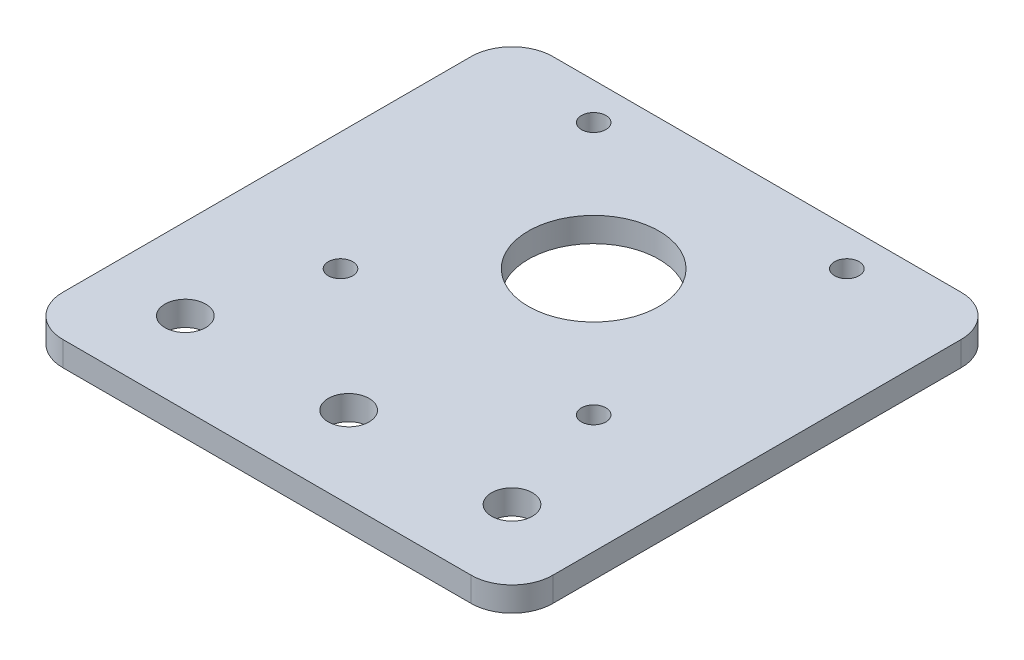
ISO-10303-21;
HEADER;
FILE_DESCRIPTION(('STEP AP214'),'2;1');
FILE_NAME('part.step','',(''),(''),'','','');
FILE_SCHEMA(('AUTOMOTIVE_DESIGN { 1 0 10303 214 1 1 1 1 }'));
ENDSEC;
DATA;
#1=APPLICATION_CONTEXT('core data for automotive mechanical design processes');
#2=APPLICATION_PROTOCOL_DEFINITION('international standard','automotive_design',2000,#1);
#3=PRODUCT_CONTEXT('',#1,'mechanical');
#4=PRODUCT('Part','Part','',(#3));
#5=PRODUCT_RELATED_PRODUCT_CATEGORY('part','',(#4));
#6=PRODUCT_DEFINITION_FORMATION('','',#4);
#7=PRODUCT_DEFINITION_CONTEXT('part definition',#1,'design');
#8=PRODUCT_DEFINITION('design','',#6,#7);
#9=PRODUCT_DEFINITION_SHAPE('','',#8);
#10=(LENGTH_UNIT() NAMED_UNIT(*) SI_UNIT(.MILLI.,.METRE.));
#11=(NAMED_UNIT(*) PLANE_ANGLE_UNIT() SI_UNIT($,.RADIAN.));
#12=(NAMED_UNIT(*) SI_UNIT($,.STERADIAN.) SOLID_ANGLE_UNIT());
#13=UNCERTAINTY_MEASURE_WITH_UNIT(LENGTH_MEASURE(1.E-05),#10,'distance_accuracy_value','');
#14=(GEOMETRIC_REPRESENTATION_CONTEXT(3) GLOBAL_UNCERTAINTY_ASSIGNED_CONTEXT((#13)) GLOBAL_UNIT_ASSIGNED_CONTEXT((#10,
#11,#12)) REPRESENTATION_CONTEXT('',''));
#15=CARTESIAN_POINT('',(0.,0.,0.));
#16=DIRECTION('',(0.,0.,1.));
#17=DIRECTION('',(1.,0.,0.));
#18=AXIS2_PLACEMENT_3D('',#15,#16,#17);
#19=CARTESIAN_POINT('',(0.,3.,0.));
#20=DIRECTION('',(0.,-1.,0.));
#21=DIRECTION('',(0.,0.,-1.));
#22=AXIS2_PLACEMENT_3D('',#19,#20,#21);
#23=PLANE('',#22);
#24=CARTESIAN_POINT('',(0.,3.,30.));
#25=DIRECTION('',(0.,1.,0.));
#26=DIRECTION('',(0.,0.,1.));
#27=AXIS2_PLACEMENT_3D('',#24,#25,#26);
#28=CIRCLE('',#27,2.5);
#29=CARTESIAN_POINT('',(0.,3.,32.5));
#30=VERTEX_POINT('',#29);
#31=EDGE_CURVE('E216',#30,#30,#28,.T.);
#32=ORIENTED_EDGE('',*,*,#31,.F.);
#33=EDGE_LOOP('',(#32));
#34=FACE_BOUND('',#33,.T.);
#35=CARTESIAN_POINT('',(-20.,3.,30.));
#36=DIRECTION('',(0.,1.,0.));
#37=DIRECTION('',(0.,0.,1.));
#38=AXIS2_PLACEMENT_3D('',#35,#36,#37);
#39=CIRCLE('',#38,2.5);
#40=CARTESIAN_POINT('',(-20.,3.,32.5));
#41=VERTEX_POINT('',#40);
#42=EDGE_CURVE('E213',#41,#41,#39,.T.);
#43=ORIENTED_EDGE('',*,*,#42,.F.);
#44=EDGE_LOOP('',(#43));
#45=FACE_BOUND('',#44,.T.);
#46=CARTESIAN_POINT('',(15.5,3.,-15.5));
#47=DIRECTION('',(0.,1.,0.));
#48=DIRECTION('',(0.,0.,1.));
#49=AXIS2_PLACEMENT_3D('',#46,#47,#48);
#50=CIRCLE('',#49,1.5);
#51=CARTESIAN_POINT('',(15.5,3.,-14.));
#52=VERTEX_POINT('',#51);
#53=EDGE_CURVE('E204',#52,#52,#50,.T.);
#54=ORIENTED_EDGE('',*,*,#53,.F.);
#55=EDGE_LOOP('',(#54));
#56=FACE_BOUND('',#55,.T.);
#57=CARTESIAN_POINT('',(-15.5,3.,-15.5));
#58=DIRECTION('',(0.,1.,0.));
#59=DIRECTION('',(0.,0.,1.));
#60=AXIS2_PLACEMENT_3D('',#57,#58,#59);
#61=CIRCLE('',#60,1.5);
#62=CARTESIAN_POINT('',(-15.5,3.,-14.));
#63=VERTEX_POINT('',#62);
#64=EDGE_CURVE('E201',#63,#63,#61,.T.);
#65=ORIENTED_EDGE('',*,*,#64,.F.);
#66=EDGE_LOOP('',(#65));
#67=FACE_BOUND('',#66,.T.);
#68=DIRECTION('',(1.,0.,0.));
#69=VECTOR('',#68,1.);
#70=CARTESIAN_POINT('',(-30.,3.,40.));
#71=LINE('',#70,#69);
#72=CARTESIAN_POINT('',(-25.,3.,40.));
#73=VERTEX_POINT('',#72);
#74=CARTESIAN_POINT('',(25.,3.,40.));
#75=VERTEX_POINT('',#74);
#76=EDGE_CURVE('E137',#73,#75,#71,.T.);
#77=ORIENTED_EDGE('',*,*,#76,.T.);
#78=CARTESIAN_POINT('',(25.,3.,35.));
#79=DIRECTION('',(0.,-1.,0.));
#80=DIRECTION('',(0.,0.,-1.));
#81=AXIS2_PLACEMENT_3D('',#78,#79,#80);
#82=CIRCLE('',#81,5.);
#83=CARTESIAN_POINT('',(30.,3.,35.));
#84=VERTEX_POINT('',#83);
#85=EDGE_CURVE('E170',#75,#84,#82,.F.);
#86=ORIENTED_EDGE('',*,*,#85,.T.);
#87=DIRECTION('',(0.,0.,-1.));
#88=VECTOR('',#87,1.);
#89=CARTESIAN_POINT('',(30.,3.,-20.));
#90=LINE('',#89,#88);
#91=CARTESIAN_POINT('',(30.,3.,-15.));
#92=VERTEX_POINT('',#91);
#93=EDGE_CURVE('E119',#84,#92,#90,.T.);
#94=ORIENTED_EDGE('',*,*,#93,.T.);
#95=CARTESIAN_POINT('',(25.,3.,-15.));
#96=DIRECTION('',(0.,-1.,0.));
#97=DIRECTION('',(0.,0.,-1.));
#98=AXIS2_PLACEMENT_3D('',#95,#96,#97);
#99=CIRCLE('',#98,5.);
#100=CARTESIAN_POINT('',(25.,3.,-20.));
#101=VERTEX_POINT('',#100);
#102=EDGE_CURVE('E168',#92,#101,#99,.F.);
#103=ORIENTED_EDGE('',*,*,#102,.T.);
#104=DIRECTION('',(-1.,0.,0.));
#105=VECTOR('',#104,1.);
#106=CARTESIAN_POINT('',(-30.,3.,-20.));
#107=LINE('',#106,#105);
#108=CARTESIAN_POINT('',(-25.,3.,-20.));
#109=VERTEX_POINT('',#108);
#110=EDGE_CURVE('E181',#101,#109,#107,.T.);
#111=ORIENTED_EDGE('',*,*,#110,.T.);
#112=CARTESIAN_POINT('',(-25.,3.,-15.));
#113=DIRECTION('',(0.,-1.,0.));
#114=DIRECTION('',(0.,0.,-1.));
#115=AXIS2_PLACEMENT_3D('',#112,#113,#114);
#116=CIRCLE('',#115,5.);
#117=CARTESIAN_POINT('',(-30.,3.,-15.));
#118=VERTEX_POINT('',#117);
#119=EDGE_CURVE('E54',#109,#118,#116,.F.);
#120=ORIENTED_EDGE('',*,*,#119,.T.);
#121=DIRECTION('',(0.,0.,1.));
#122=VECTOR('',#121,1.);
#123=CARTESIAN_POINT('',(-30.,3.,-20.));
#124=LINE('',#123,#122);
#125=CARTESIAN_POINT('',(-30.,3.,35.));
#126=VERTEX_POINT('',#125);
#127=EDGE_CURVE('E142',#118,#126,#124,.T.);
#128=ORIENTED_EDGE('',*,*,#127,.T.);
#129=CARTESIAN_POINT('',(-25.,3.,35.));
#130=DIRECTION('',(0.,-1.,0.));
#131=DIRECTION('',(0.,0.,-1.));
#132=AXIS2_PLACEMENT_3D('',#129,#130,#131);
#133=CIRCLE('',#132,5.);
#134=EDGE_CURVE('E165',#126,#73,#133,.F.);
#135=ORIENTED_EDGE('',*,*,#134,.T.);
#136=EDGE_LOOP('',(#77,#86,#94,#103,#111,#120,#128,#135));
#137=FACE_BOUND('',#136,.T.);
#138=CARTESIAN_POINT('',(0.,3.,0.));
#139=DIRECTION('',(0.,1.,0.));
#140=DIRECTION('',(0.,0.,1.));
#141=AXIS2_PLACEMENT_3D('',#138,#139,#140);
#142=CIRCLE('',#141,8.);
#143=CARTESIAN_POINT('',(0.,3.,8.));
#144=VERTEX_POINT('',#143);
#145=EDGE_CURVE('E132',#144,#144,#142,.T.);
#146=ORIENTED_EDGE('',*,*,#145,.F.);
#147=EDGE_LOOP('',(#146));
#148=FACE_BOUND('',#147,.T.);
#149=CARTESIAN_POINT('',(-15.5,3.,15.5));
#150=DIRECTION('',(0.,1.,0.));
#151=DIRECTION('',(0.,0.,1.));
#152=AXIS2_PLACEMENT_3D('',#149,#150,#151);
#153=CIRCLE('',#152,1.5);
#154=CARTESIAN_POINT('',(-15.5,3.,17.));
#155=VERTEX_POINT('',#154);
#156=EDGE_CURVE('E141',#155,#155,#153,.T.);
#157=ORIENTED_EDGE('',*,*,#156,.F.);
#158=EDGE_LOOP('',(#157));
#159=FACE_BOUND('',#158,.T.);
#160=CARTESIAN_POINT('',(15.5,3.,15.5));
#161=DIRECTION('',(0.,1.,0.));
#162=DIRECTION('',(0.,0.,1.));
#163=AXIS2_PLACEMENT_3D('',#160,#161,#162);
#164=CIRCLE('',#163,1.5);
#165=CARTESIAN_POINT('',(15.5,3.,17.));
#166=VERTEX_POINT('',#165);
#167=EDGE_CURVE('E148',#166,#166,#164,.T.);
#168=ORIENTED_EDGE('',*,*,#167,.F.);
#169=EDGE_LOOP('',(#168));
#170=FACE_BOUND('',#169,.T.);
#171=CARTESIAN_POINT('',(20.,3.,30.));
#172=DIRECTION('',(0.,1.,0.));
#173=DIRECTION('',(0.,0.,1.));
#174=AXIS2_PLACEMENT_3D('',#171,#172,#173);
#175=CIRCLE('',#174,2.5);
#176=CARTESIAN_POINT('',(20.,3.,32.5));
#177=VERTEX_POINT('',#176);
#178=EDGE_CURVE('E154',#177,#177,#175,.T.);
#179=ORIENTED_EDGE('',*,*,#178,.F.);
#180=EDGE_LOOP('',(#179));
#181=FACE_BOUND('',#180,.T.);
#182=ADVANCED_FACE('F33',(#34,#45,#56,#67,#137,#148,#159,#170,#181),#23,.F.);
#183=CARTESIAN_POINT('',(0.,0.,0.));
#184=DIRECTION('',(0.,-1.,0.));
#185=DIRECTION('',(0.,0.,-1.));
#186=AXIS2_PLACEMENT_3D('',#183,#184,#185);
#187=PLANE('',#186);
#188=CARTESIAN_POINT('',(0.,0.,30.));
#189=DIRECTION('',(0.,1.,0.));
#190=DIRECTION('',(0.,0.,1.));
#191=AXIS2_PLACEMENT_3D('',#188,#189,#190);
#192=CIRCLE('',#191,2.5);
#193=CARTESIAN_POINT('',(0.,0.,32.5));
#194=VERTEX_POINT('',#193);
#195=EDGE_CURVE('E221',#194,#194,#192,.T.);
#196=ORIENTED_EDGE('',*,*,#195,.T.);
#197=EDGE_LOOP('',(#196));
#198=FACE_BOUND('',#197,.T.);
#199=CARTESIAN_POINT('',(-20.,0.,30.));
#200=DIRECTION('',(0.,1.,0.));
#201=DIRECTION('',(0.,0.,1.));
#202=AXIS2_PLACEMENT_3D('',#199,#200,#201);
#203=CIRCLE('',#202,2.5);
#204=CARTESIAN_POINT('',(-20.,0.,32.5));
#205=VERTEX_POINT('',#204);
#206=EDGE_CURVE('E212',#205,#205,#203,.T.);
#207=ORIENTED_EDGE('',*,*,#206,.T.);
#208=EDGE_LOOP('',(#207));
#209=FACE_BOUND('',#208,.T.);
#210=CARTESIAN_POINT('',(15.5,0.,-15.5));
#211=DIRECTION('',(0.,1.,0.));
#212=DIRECTION('',(0.,0.,1.));
#213=AXIS2_PLACEMENT_3D('',#210,#211,#212);
#214=CIRCLE('',#213,1.5);
#215=CARTESIAN_POINT('',(15.5,0.,-14.));
#216=VERTEX_POINT('',#215);
#217=EDGE_CURVE('E209',#216,#216,#214,.T.);
#218=ORIENTED_EDGE('',*,*,#217,.T.);
#219=EDGE_LOOP('',(#218));
#220=FACE_BOUND('',#219,.T.);
#221=CARTESIAN_POINT('',(-15.5,0.,-15.5));
#222=DIRECTION('',(0.,1.,0.));
#223=DIRECTION('',(0.,0.,1.));
#224=AXIS2_PLACEMENT_3D('',#221,#222,#223);
#225=CIRCLE('',#224,1.5);
#226=CARTESIAN_POINT('',(-15.5,0.,-14.));
#227=VERTEX_POINT('',#226);
#228=EDGE_CURVE('E198',#227,#227,#225,.T.);
#229=ORIENTED_EDGE('',*,*,#228,.T.);
#230=EDGE_LOOP('',(#229));
#231=FACE_BOUND('',#230,.T.);
#232=DIRECTION('',(0.,0.,-1.));
#233=VECTOR('',#232,1.);
#234=CARTESIAN_POINT('',(30.,0.,-20.));
#235=LINE('',#234,#233);
#236=CARTESIAN_POINT('',(30.,0.,35.));
#237=VERTEX_POINT('',#236);
#238=CARTESIAN_POINT('',(30.,0.,-15.));
#239=VERTEX_POINT('',#238);
#240=EDGE_CURVE('E116',#237,#239,#235,.T.);
#241=ORIENTED_EDGE('',*,*,#240,.F.);
#242=CARTESIAN_POINT('',(25.,0.,35.));
#243=DIRECTION('',(0.,-1.,0.));
#244=DIRECTION('',(0.,0.,-1.));
#245=AXIS2_PLACEMENT_3D('',#242,#243,#244);
#246=CIRCLE('',#245,5.);
#247=CARTESIAN_POINT('',(25.,0.,40.));
#248=VERTEX_POINT('',#247);
#249=EDGE_CURVE('E99',#237,#248,#246,.T.);
#250=ORIENTED_EDGE('',*,*,#249,.T.);
#251=DIRECTION('',(1.,0.,0.));
#252=VECTOR('',#251,1.);
#253=CARTESIAN_POINT('',(-30.,0.,40.));
#254=LINE('',#253,#252);
#255=CARTESIAN_POINT('',(-25.,0.,40.));
#256=VERTEX_POINT('',#255);
#257=EDGE_CURVE('E127',#256,#248,#254,.T.);
#258=ORIENTED_EDGE('',*,*,#257,.F.);
#259=CARTESIAN_POINT('',(-25.,0.,35.));
#260=DIRECTION('',(0.,-1.,0.));
#261=DIRECTION('',(0.,0.,-1.));
#262=AXIS2_PLACEMENT_3D('',#259,#260,#261);
#263=CIRCLE('',#262,5.);
#264=CARTESIAN_POINT('',(-30.,0.,35.));
#265=VERTEX_POINT('',#264);
#266=EDGE_CURVE('E120',#256,#265,#263,.T.);
#267=ORIENTED_EDGE('',*,*,#266,.T.);
#268=DIRECTION('',(0.,0.,1.));
#269=VECTOR('',#268,1.);
#270=CARTESIAN_POINT('',(-30.,0.,-20.));
#271=LINE('',#270,#269);
#272=CARTESIAN_POINT('',(-30.,0.,-15.));
#273=VERTEX_POINT('',#272);
#274=EDGE_CURVE('E130',#273,#265,#271,.T.);
#275=ORIENTED_EDGE('',*,*,#274,.F.);
#276=CARTESIAN_POINT('',(-25.,0.,-15.));
#277=DIRECTION('',(0.,-1.,0.));
#278=DIRECTION('',(0.,0.,-1.));
#279=AXIS2_PLACEMENT_3D('',#276,#277,#278);
#280=CIRCLE('',#279,5.);
#281=CARTESIAN_POINT('',(-25.,0.,-20.));
#282=VERTEX_POINT('',#281);
#283=EDGE_CURVE('E159',#273,#282,#280,.T.);
#284=ORIENTED_EDGE('',*,*,#283,.T.);
#285=DIRECTION('',(-1.,0.,0.));
#286=VECTOR('',#285,1.);
#287=CARTESIAN_POINT('',(-30.,0.,-20.));
#288=LINE('',#287,#286);
#289=CARTESIAN_POINT('',(25.,0.,-20.));
#290=VERTEX_POINT('',#289);
#291=EDGE_CURVE('E126',#290,#282,#288,.T.);
#292=ORIENTED_EDGE('',*,*,#291,.F.);
#293=CARTESIAN_POINT('',(25.,0.,-15.));
#294=DIRECTION('',(0.,-1.,0.));
#295=DIRECTION('',(0.,0.,-1.));
#296=AXIS2_PLACEMENT_3D('',#293,#294,#295);
#297=CIRCLE('',#296,5.);
#298=EDGE_CURVE('E110',#290,#239,#297,.T.);
#299=ORIENTED_EDGE('',*,*,#298,.T.);
#300=EDGE_LOOP('',(#241,#250,#258,#267,#275,#284,#292,#299));
#301=FACE_BOUND('',#300,.T.);
#302=CARTESIAN_POINT('',(0.,0.,0.));
#303=DIRECTION('',(0.,1.,0.));
#304=DIRECTION('',(0.,0.,1.));
#305=AXIS2_PLACEMENT_3D('',#302,#303,#304);
#306=CIRCLE('',#305,8.);
#307=CARTESIAN_POINT('',(0.,0.,8.));
#308=VERTEX_POINT('',#307);
#309=EDGE_CURVE('E195',#308,#308,#306,.T.);
#310=ORIENTED_EDGE('',*,*,#309,.T.);
#311=EDGE_LOOP('',(#310));
#312=FACE_BOUND('',#311,.T.);
#313=CARTESIAN_POINT('',(-15.5,0.,15.5));
#314=DIRECTION('',(0.,1.,0.));
#315=DIRECTION('',(0.,0.,1.));
#316=AXIS2_PLACEMENT_3D('',#313,#314,#315);
#317=CIRCLE('',#316,1.5);
#318=CARTESIAN_POINT('',(-15.5,0.,17.));
#319=VERTEX_POINT('',#318);
#320=EDGE_CURVE('E138',#319,#319,#317,.T.);
#321=ORIENTED_EDGE('',*,*,#320,.T.);
#322=EDGE_LOOP('',(#321));
#323=FACE_BOUND('',#322,.T.);
#324=CARTESIAN_POINT('',(15.5,0.,15.5));
#325=DIRECTION('',(0.,1.,0.));
#326=DIRECTION('',(0.,0.,1.));
#327=AXIS2_PLACEMENT_3D('',#324,#325,#326);
#328=CIRCLE('',#327,1.5);
#329=CARTESIAN_POINT('',(15.5,0.,17.));
#330=VERTEX_POINT('',#329);
#331=EDGE_CURVE('E145',#330,#330,#328,.T.);
#332=ORIENTED_EDGE('',*,*,#331,.T.);
#333=EDGE_LOOP('',(#332));
#334=FACE_BOUND('',#333,.T.);
#335=CARTESIAN_POINT('',(20.,0.,30.));
#336=DIRECTION('',(0.,1.,0.));
#337=DIRECTION('',(0.,0.,1.));
#338=AXIS2_PLACEMENT_3D('',#335,#336,#337);
#339=CIRCLE('',#338,2.5);
#340=CARTESIAN_POINT('',(20.,0.,32.5));
#341=VERTEX_POINT('',#340);
#342=EDGE_CURVE('E151',#341,#341,#339,.T.);
#343=ORIENTED_EDGE('',*,*,#342,.T.);
#344=EDGE_LOOP('',(#343));
#345=FACE_BOUND('',#344,.T.);
#346=ADVANCED_FACE('F123',(#198,#209,#220,#231,#301,#312,#323,#334,#345),#187,.T.);
#347=CARTESIAN_POINT('',(-30.,3.,40.));
#348=DIRECTION('',(0.,0.,-1.));
#349=DIRECTION('',(-1.,0.,0.));
#350=AXIS2_PLACEMENT_3D('',#347,#348,#349);
#351=PLANE('',#350);
#352=ORIENTED_EDGE('',*,*,#257,.T.);
#353=DIRECTION('',(0.,-1.,0.));
#354=VECTOR('',#353,1.);
#355=CARTESIAN_POINT('',(25.,3.,40.));
#356=LINE('',#355,#354);
#357=EDGE_CURVE('E104',#248,#75,#356,.F.);
#358=ORIENTED_EDGE('',*,*,#357,.T.);
#359=ORIENTED_EDGE('',*,*,#76,.F.);
#360=DIRECTION('',(0.,-1.,0.));
#361=VECTOR('',#360,1.);
#362=CARTESIAN_POINT('',(-25.,3.,40.));
#363=LINE('',#362,#361);
#364=EDGE_CURVE('E109',#73,#256,#363,.T.);
#365=ORIENTED_EDGE('',*,*,#364,.T.);
#366=EDGE_LOOP('',(#352,#358,#359,#365));
#367=FACE_BOUND('',#366,.T.);
#368=ADVANCED_FACE('F276',(#367),#351,.F.);
#369=CARTESIAN_POINT('',(30.,3.,-20.));
#370=DIRECTION('',(-1.,0.,0.));
#371=DIRECTION('',(0.,0.,1.));
#372=AXIS2_PLACEMENT_3D('',#369,#370,#371);
#373=PLANE('',#372);
#374=ORIENTED_EDGE('',*,*,#93,.F.);
#375=DIRECTION('',(0.,-1.,0.));
#376=VECTOR('',#375,1.);
#377=CARTESIAN_POINT('',(30.,3.,35.));
#378=LINE('',#377,#376);
#379=EDGE_CURVE('E103',#84,#237,#378,.T.);
#380=ORIENTED_EDGE('',*,*,#379,.T.);
#381=ORIENTED_EDGE('',*,*,#240,.T.);
#382=DIRECTION('',(0.,-1.,0.));
#383=VECTOR('',#382,1.);
#384=CARTESIAN_POINT('',(30.,3.,-15.));
#385=LINE('',#384,#383);
#386=EDGE_CURVE('E121',#239,#92,#385,.F.);
#387=ORIENTED_EDGE('',*,*,#386,.T.);
#388=EDGE_LOOP('',(#374,#380,#381,#387));
#389=FACE_BOUND('',#388,.T.);
#390=ADVANCED_FACE('F115',(#389),#373,.F.);
#391=CARTESIAN_POINT('',(-30.,3.,-20.));
#392=DIRECTION('',(0.,0.,1.));
#393=DIRECTION('',(1.,0.,0.));
#394=AXIS2_PLACEMENT_3D('',#391,#392,#393);
#395=PLANE('',#394);
#396=ORIENTED_EDGE('',*,*,#110,.F.);
#397=DIRECTION('',(0.,-1.,0.));
#398=VECTOR('',#397,1.);
#399=CARTESIAN_POINT('',(25.,3.,-20.));
#400=LINE('',#399,#398);
#401=EDGE_CURVE('E174',#101,#290,#400,.T.);
#402=ORIENTED_EDGE('',*,*,#401,.T.);
#403=ORIENTED_EDGE('',*,*,#291,.T.);
#404=DIRECTION('',(0.,-1.,0.));
#405=VECTOR('',#404,1.);
#406=CARTESIAN_POINT('',(-25.,3.,-20.));
#407=LINE('',#406,#405);
#408=EDGE_CURVE('E172',#282,#109,#407,.F.);
#409=ORIENTED_EDGE('',*,*,#408,.T.);
#410=EDGE_LOOP('',(#396,#402,#403,#409));
#411=FACE_BOUND('',#410,.T.);
#412=ADVANCED_FACE('F179',(#411),#395,.F.);
#413=CARTESIAN_POINT('',(-30.,3.,-20.));
#414=DIRECTION('',(1.,0.,0.));
#415=DIRECTION('',(0.,0.,-1.));
#416=AXIS2_PLACEMENT_3D('',#413,#414,#415);
#417=PLANE('',#416);
#418=ORIENTED_EDGE('',*,*,#127,.F.);
#419=DIRECTION('',(0.,-1.,0.));
#420=VECTOR('',#419,1.);
#421=CARTESIAN_POINT('',(-30.,3.,-15.));
#422=LINE('',#421,#420);
#423=EDGE_CURVE('E11',#118,#273,#422,.T.);
#424=ORIENTED_EDGE('',*,*,#423,.T.);
#425=ORIENTED_EDGE('',*,*,#274,.T.);
#426=DIRECTION('',(0.,-1.,0.));
#427=VECTOR('',#426,1.);
#428=CARTESIAN_POINT('',(-30.,3.,35.));
#429=LINE('',#428,#427);
#430=EDGE_CURVE('E41',#265,#126,#429,.F.);
#431=ORIENTED_EDGE('',*,*,#430,.T.);
#432=EDGE_LOOP('',(#418,#424,#425,#431));
#433=FACE_BOUND('',#432,.T.);
#434=ADVANCED_FACE('F188',(#433),#417,.F.);
#435=CARTESIAN_POINT('',(0.,3.,0.));
#436=DIRECTION('',(0.,-1.,0.));
#437=DIRECTION('',(0.,0.,-1.));
#438=AXIS2_PLACEMENT_3D('',#435,#436,#437);
#439=CYLINDRICAL_SURFACE('',#438,8.);
#440=ORIENTED_EDGE('',*,*,#145,.T.);
#441=EDGE_LOOP('',(#440));
#442=FACE_BOUND('',#441,.T.);
#443=ORIENTED_EDGE('',*,*,#309,.F.);
#444=EDGE_LOOP('',(#443));
#445=FACE_BOUND('',#444,.T.);
#446=ADVANCED_FACE('F308',(#442,#445),#439,.F.);
#447=CARTESIAN_POINT('',(-15.5,0.,-15.5));
#448=DIRECTION('',(0.,1.,0.));
#449=DIRECTION('',(0.,0.,1.));
#450=AXIS2_PLACEMENT_3D('',#447,#448,#449);
#451=CYLINDRICAL_SURFACE('',#450,1.5);
#452=ORIENTED_EDGE('',*,*,#228,.F.);
#453=EDGE_LOOP('',(#452));
#454=FACE_BOUND('',#453,.T.);
#455=ORIENTED_EDGE('',*,*,#64,.T.);
#456=EDGE_LOOP('',(#455));
#457=FACE_BOUND('',#456,.T.);
#458=ADVANCED_FACE('F295',(#454,#457),#451,.F.);
#459=CARTESIAN_POINT('',(15.5,0.,-15.5));
#460=DIRECTION('',(0.,1.,0.));
#461=DIRECTION('',(0.,0.,1.));
#462=AXIS2_PLACEMENT_3D('',#459,#460,#461);
#463=CYLINDRICAL_SURFACE('',#462,1.5);
#464=ORIENTED_EDGE('',*,*,#217,.F.);
#465=EDGE_LOOP('',(#464));
#466=FACE_BOUND('',#465,.T.);
#467=ORIENTED_EDGE('',*,*,#53,.T.);
#468=EDGE_LOOP('',(#467));
#469=FACE_BOUND('',#468,.T.);
#470=ADVANCED_FACE('F288',(#466,#469),#463,.F.);
#471=CARTESIAN_POINT('',(-15.5,0.,15.5));
#472=DIRECTION('',(0.,1.,0.));
#473=DIRECTION('',(0.,0.,1.));
#474=AXIS2_PLACEMENT_3D('',#471,#472,#473);
#475=CYLINDRICAL_SURFACE('',#474,1.5);
#476=ORIENTED_EDGE('',*,*,#320,.F.);
#477=EDGE_LOOP('',(#476));
#478=FACE_BOUND('',#477,.T.);
#479=ORIENTED_EDGE('',*,*,#156,.T.);
#480=EDGE_LOOP('',(#479));
#481=FACE_BOUND('',#480,.T.);
#482=ADVANCED_FACE('F286',(#478,#481),#475,.F.);
#483=CARTESIAN_POINT('',(15.5,0.,15.5));
#484=DIRECTION('',(0.,1.,0.));
#485=DIRECTION('',(0.,0.,1.));
#486=AXIS2_PLACEMENT_3D('',#483,#484,#485);
#487=CYLINDRICAL_SURFACE('',#486,1.5);
#488=ORIENTED_EDGE('',*,*,#331,.F.);
#489=EDGE_LOOP('',(#488));
#490=FACE_BOUND('',#489,.T.);
#491=ORIENTED_EDGE('',*,*,#167,.T.);
#492=EDGE_LOOP('',(#491));
#493=FACE_BOUND('',#492,.T.);
#494=ADVANCED_FACE('F263',(#490,#493),#487,.F.);
#495=CARTESIAN_POINT('',(-20.,0.,30.));
#496=DIRECTION('',(0.,1.,0.));
#497=DIRECTION('',(0.,0.,1.));
#498=AXIS2_PLACEMENT_3D('',#495,#496,#497);
#499=CYLINDRICAL_SURFACE('',#498,2.5);
#500=ORIENTED_EDGE('',*,*,#206,.F.);
#501=EDGE_LOOP('',(#500));
#502=FACE_BOUND('',#501,.T.);
#503=ORIENTED_EDGE('',*,*,#42,.T.);
#504=EDGE_LOOP('',(#503));
#505=FACE_BOUND('',#504,.T.);
#506=ADVANCED_FACE('F231',(#502,#505),#499,.F.);
#507=CARTESIAN_POINT('',(0.,0.,30.));
#508=DIRECTION('',(0.,1.,0.));
#509=DIRECTION('',(0.,0.,1.));
#510=AXIS2_PLACEMENT_3D('',#507,#508,#509);
#511=CYLINDRICAL_SURFACE('',#510,2.5);
#512=ORIENTED_EDGE('',*,*,#195,.F.);
#513=EDGE_LOOP('',(#512));
#514=FACE_BOUND('',#513,.T.);
#515=ORIENTED_EDGE('',*,*,#31,.T.);
#516=EDGE_LOOP('',(#515));
#517=FACE_BOUND('',#516,.T.);
#518=ADVANCED_FACE('F227',(#514,#517),#511,.F.);
#519=CARTESIAN_POINT('',(20.,0.,30.));
#520=DIRECTION('',(0.,1.,0.));
#521=DIRECTION('',(0.,0.,1.));
#522=AXIS2_PLACEMENT_3D('',#519,#520,#521);
#523=CYLINDRICAL_SURFACE('',#522,2.5);
#524=ORIENTED_EDGE('',*,*,#342,.F.);
#525=EDGE_LOOP('',(#524));
#526=FACE_BOUND('',#525,.T.);
#527=ORIENTED_EDGE('',*,*,#178,.T.);
#528=EDGE_LOOP('',(#527));
#529=FACE_BOUND('',#528,.T.);
#530=ADVANCED_FACE('F230',(#526,#529),#523,.F.);
#531=CARTESIAN_POINT('',(25.,3.,35.));
#532=DIRECTION('',(0.,-1.,0.));
#533=DIRECTION('',(0.,0.,-1.));
#534=AXIS2_PLACEMENT_3D('',#531,#532,#533);
#535=CYLINDRICAL_SURFACE('',#534,5.);
#536=ORIENTED_EDGE('',*,*,#85,.F.);
#537=ORIENTED_EDGE('',*,*,#357,.F.);
#538=ORIENTED_EDGE('',*,*,#249,.F.);
#539=ORIENTED_EDGE('',*,*,#379,.F.);
#540=EDGE_LOOP('',(#536,#537,#538,#539));
#541=FACE_BOUND('',#540,.T.);
#542=ADVANCED_FACE('F102',(#541),#535,.T.);
#543=CARTESIAN_POINT('',(25.,3.,-15.));
#544=DIRECTION('',(0.,-1.,0.));
#545=DIRECTION('',(0.,0.,-1.));
#546=AXIS2_PLACEMENT_3D('',#543,#544,#545);
#547=CYLINDRICAL_SURFACE('',#546,5.);
#548=ORIENTED_EDGE('',*,*,#102,.F.);
#549=ORIENTED_EDGE('',*,*,#386,.F.);
#550=ORIENTED_EDGE('',*,*,#298,.F.);
#551=ORIENTED_EDGE('',*,*,#401,.F.);
#552=EDGE_LOOP('',(#548,#549,#550,#551));
#553=FACE_BOUND('',#552,.T.);
#554=ADVANCED_FACE('F259',(#553),#547,.T.);
#555=CARTESIAN_POINT('',(-25.,3.,-15.));
#556=DIRECTION('',(0.,-1.,0.));
#557=DIRECTION('',(0.,0.,-1.));
#558=AXIS2_PLACEMENT_3D('',#555,#556,#557);
#559=CYLINDRICAL_SURFACE('',#558,5.);
#560=ORIENTED_EDGE('',*,*,#119,.F.);
#561=ORIENTED_EDGE('',*,*,#408,.F.);
#562=ORIENTED_EDGE('',*,*,#283,.F.);
#563=ORIENTED_EDGE('',*,*,#423,.F.);
#564=EDGE_LOOP('',(#560,#561,#562,#563));
#565=FACE_BOUND('',#564,.T.);
#566=ADVANCED_FACE('F187',(#565),#559,.T.);
#567=CARTESIAN_POINT('',(-25.,3.,35.));
#568=DIRECTION('',(0.,-1.,0.));
#569=DIRECTION('',(0.,0.,-1.));
#570=AXIS2_PLACEMENT_3D('',#567,#568,#569);
#571=CYLINDRICAL_SURFACE('',#570,5.);
#572=ORIENTED_EDGE('',*,*,#134,.F.);
#573=ORIENTED_EDGE('',*,*,#430,.F.);
#574=ORIENTED_EDGE('',*,*,#266,.F.);
#575=ORIENTED_EDGE('',*,*,#364,.F.);
#576=EDGE_LOOP('',(#572,#573,#574,#575));
#577=FACE_BOUND('',#576,.T.);
#578=ADVANCED_FACE('F35',(#577),#571,.T.);
#579=CLOSED_SHELL('',(#182,#346,#368,#390,#412,#434,#446,#458,#470,#482,#494,#506,#518,#530,
#542,#554,#566,#578));
#580=MANIFOLD_SOLID_BREP('B2',#579);
#581=ADVANCED_BREP_SHAPE_REPRESENTATION('',(#18,#580),#14);
#582=SHAPE_DEFINITION_REPRESENTATION(#9,#581);
ENDSEC;
END-ISO-10303-21;
